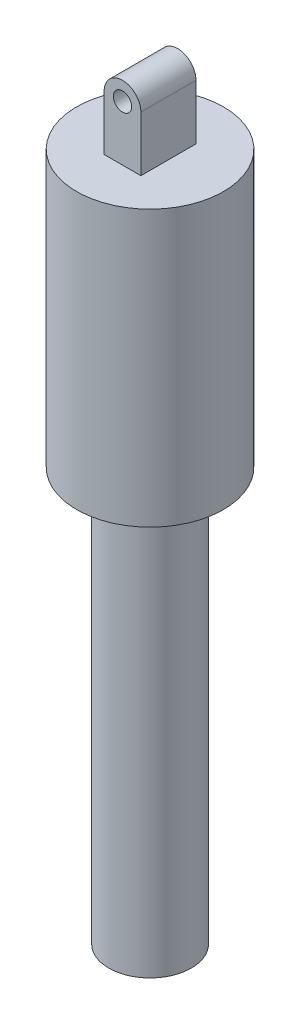
ISO-10303-21;
HEADER;
FILE_DESCRIPTION(('STEP AP214'),'2;1');
FILE_NAME('part.step','',(''),(''),'','','');
FILE_SCHEMA(('AUTOMOTIVE_DESIGN { 1 0 10303 214 1 1 1 1 }'));
ENDSEC;
DATA;
#1=APPLICATION_CONTEXT('core data for automotive mechanical design processes');
#2=APPLICATION_PROTOCOL_DEFINITION('international standard','automotive_design',2000,#1);
#3=PRODUCT_CONTEXT('',#1,'mechanical');
#4=PRODUCT('Part','Part','',(#3));
#5=PRODUCT_RELATED_PRODUCT_CATEGORY('part','',(#4));
#6=PRODUCT_DEFINITION_FORMATION('','',#4);
#7=PRODUCT_DEFINITION_CONTEXT('part definition',#1,'design');
#8=PRODUCT_DEFINITION('design','',#6,#7);
#9=PRODUCT_DEFINITION_SHAPE('','',#8);
#10=(LENGTH_UNIT() NAMED_UNIT(*) SI_UNIT(.MILLI.,.METRE.));
#11=(NAMED_UNIT(*) PLANE_ANGLE_UNIT() SI_UNIT($,.RADIAN.));
#12=(NAMED_UNIT(*) SI_UNIT($,.STERADIAN.) SOLID_ANGLE_UNIT());
#13=UNCERTAINTY_MEASURE_WITH_UNIT(LENGTH_MEASURE(1.E-05),#10,'distance_accuracy_value','');
#14=(GEOMETRIC_REPRESENTATION_CONTEXT(3) GLOBAL_UNCERTAINTY_ASSIGNED_CONTEXT((#13)) GLOBAL_UNIT_ASSIGNED_CONTEXT((#10,
#11,#12)) REPRESENTATION_CONTEXT('',''));
#15=CARTESIAN_POINT('',(0.,0.,0.));
#16=DIRECTION('',(0.,0.,1.));
#17=DIRECTION('',(1.,0.,0.));
#18=AXIS2_PLACEMENT_3D('',#15,#16,#17);
#19=CARTESIAN_POINT('',(0.,150.,0.));
#20=DIRECTION('',(0.,1.,0.));
#21=DIRECTION('',(0.,0.,1.));
#22=AXIS2_PLACEMENT_3D('',#19,#20,#21);
#23=PLANE('',#22);
#24=CARTESIAN_POINT('',(0.,150.,0.));
#25=DIRECTION('',(0.,-1.,0.));
#26=DIRECTION('',(0.,0.,-1.));
#27=AXIS2_PLACEMENT_3D('',#24,#25,#26);
#28=CIRCLE('',#27,40.);
#29=CARTESIAN_POINT('',(0.,150.,-40.));
#30=VERTEX_POINT('',#29);
#31=EDGE_CURVE('E113',#30,#30,#28,.T.);
#32=ORIENTED_EDGE('',*,*,#31,.F.);
#33=EDGE_LOOP('',(#32));
#34=FACE_BOUND('',#33,.T.);
#35=DIRECTION('',(1.,0.,0.));
#36=VECTOR('',#35,1.);
#37=CARTESIAN_POINT('',(10.,150.,-15.));
#38=LINE('',#37,#36);
#39=CARTESIAN_POINT('',(-10.,150.,-15.));
#40=VERTEX_POINT('',#39);
#41=CARTESIAN_POINT('',(10.,150.,-15.));
#42=VERTEX_POINT('',#41);
#43=EDGE_CURVE('E48',#40,#42,#38,.T.);
#44=ORIENTED_EDGE('',*,*,#43,.T.);
#45=DIRECTION('',(0.,0.,-1.));
#46=VECTOR('',#45,1.);
#47=CARTESIAN_POINT('',(10.,150.,15.));
#48=LINE('',#47,#46);
#49=CARTESIAN_POINT('',(10.,150.,15.));
#50=VERTEX_POINT('',#49);
#51=EDGE_CURVE('E94',#50,#42,#48,.T.);
#52=ORIENTED_EDGE('',*,*,#51,.F.);
#53=DIRECTION('',(1.,0.,0.));
#54=VECTOR('',#53,1.);
#55=CARTESIAN_POINT('',(10.,150.,15.));
#56=LINE('',#55,#54);
#57=CARTESIAN_POINT('',(-10.,150.,15.));
#58=VERTEX_POINT('',#57);
#59=EDGE_CURVE('E88',#58,#50,#56,.T.);
#60=ORIENTED_EDGE('',*,*,#59,.F.);
#61=DIRECTION('',(0.,0.,-1.));
#62=VECTOR('',#61,1.);
#63=CARTESIAN_POINT('',(-10.,150.,15.));
#64=LINE('',#63,#62);
#65=EDGE_CURVE('E99',#58,#40,#64,.T.);
#66=ORIENTED_EDGE('',*,*,#65,.T.);
#67=EDGE_LOOP('',(#44,#52,#60,#66));
#68=FACE_BOUND('',#67,.T.);
#69=ADVANCED_FACE('F33',(#34,#68),#23,.T.);
#70=CARTESIAN_POINT('',(9.,0.,0.));
#71=DIRECTION('',(0.,-1.,0.));
#72=DIRECTION('',(0.,0.,-1.));
#73=AXIS2_PLACEMENT_3D('',#70,#71,#72);
#74=PLANE('',#73);
#75=CARTESIAN_POINT('',(0.,0.,0.));
#76=DIRECTION('',(0.,-1.,0.));
#77=DIRECTION('',(0.,0.,-1.));
#78=AXIS2_PLACEMENT_3D('',#75,#76,#77);
#79=CIRCLE('',#78,9.);
#80=CARTESIAN_POINT('',(0.,0.,-9.));
#81=VERTEX_POINT('',#80);
#82=EDGE_CURVE('E11',#81,#81,#79,.T.);
#83=ORIENTED_EDGE('',*,*,#82,.T.);
#84=EDGE_LOOP('',(#83));
#85=FACE_BOUND('',#84,.T.);
#86=ADVANCED_FACE('F35',(#85),#74,.T.);
#87=CARTESIAN_POINT('',(0.,0.,0.));
#88=DIRECTION('',(0.,-1.,0.));
#89=DIRECTION('',(0.,0.,-1.));
#90=AXIS2_PLACEMENT_3D('',#87,#88,#89);
#91=CYLINDRICAL_SURFACE('',#90,9.);
#92=CARTESIAN_POINT('',(0.,-225.,0.));
#93=DIRECTION('',(0.,-1.,0.));
#94=DIRECTION('',(0.,0.,-1.));
#95=AXIS2_PLACEMENT_3D('',#92,#93,#94);
#96=CIRCLE('',#95,9.);
#97=CARTESIAN_POINT('',(0.,-225.,-9.));
#98=VERTEX_POINT('',#97);
#99=EDGE_CURVE('E41',#98,#98,#96,.T.);
#100=ORIENTED_EDGE('',*,*,#99,.T.);
#101=EDGE_LOOP('',(#100));
#102=FACE_BOUND('',#101,.T.);
#103=ORIENTED_EDGE('',*,*,#82,.F.);
#104=EDGE_LOOP('',(#103));
#105=FACE_BOUND('',#104,.T.);
#106=ADVANCED_FACE('F127',(#102,#105),#91,.F.);
#107=CARTESIAN_POINT('',(22.5,-225.,0.));
#108=DIRECTION('',(0.,-1.,0.));
#109=DIRECTION('',(0.,0.,-1.));
#110=AXIS2_PLACEMENT_3D('',#107,#108,#109);
#111=PLANE('',#110);
#112=CARTESIAN_POINT('',(0.,-225.,0.));
#113=DIRECTION('',(0.,-1.,0.));
#114=DIRECTION('',(0.,0.,-1.));
#115=AXIS2_PLACEMENT_3D('',#112,#113,#114);
#116=CIRCLE('',#115,22.5);
#117=CARTESIAN_POINT('',(0.,-225.,-22.5));
#118=VERTEX_POINT('',#117);
#119=EDGE_CURVE('E122',#118,#118,#116,.T.);
#120=ORIENTED_EDGE('',*,*,#119,.T.);
#121=EDGE_LOOP('',(#120));
#122=FACE_BOUND('',#121,.T.);
#123=ORIENTED_EDGE('',*,*,#99,.F.);
#124=EDGE_LOOP('',(#123));
#125=FACE_BOUND('',#124,.T.);
#126=ADVANCED_FACE('F130',(#122,#125),#111,.T.);
#127=CARTESIAN_POINT('',(0.,0.,0.));
#128=DIRECTION('',(0.,-1.,0.));
#129=DIRECTION('',(0.,0.,-1.));
#130=AXIS2_PLACEMENT_3D('',#127,#128,#129);
#131=CYLINDRICAL_SURFACE('',#130,22.5);
#132=CARTESIAN_POINT('',(0.,0.,0.));
#133=DIRECTION('',(0.,-1.,0.));
#134=DIRECTION('',(0.,0.,-1.));
#135=AXIS2_PLACEMENT_3D('',#132,#133,#134);
#136=CIRCLE('',#135,22.5);
#137=CARTESIAN_POINT('',(0.,0.,-22.5));
#138=VERTEX_POINT('',#137);
#139=EDGE_CURVE('E119',#138,#138,#136,.T.);
#140=ORIENTED_EDGE('',*,*,#139,.T.);
#141=EDGE_LOOP('',(#140));
#142=FACE_BOUND('',#141,.T.);
#143=ORIENTED_EDGE('',*,*,#119,.F.);
#144=EDGE_LOOP('',(#143));
#145=FACE_BOUND('',#144,.T.);
#146=ADVANCED_FACE('F132',(#142,#145),#131,.T.);
#147=CARTESIAN_POINT('',(22.5,0.,0.));
#148=DIRECTION('',(0.,-1.,0.));
#149=DIRECTION('',(0.,0.,-1.));
#150=AXIS2_PLACEMENT_3D('',#147,#148,#149);
#151=PLANE('',#150);
#152=CARTESIAN_POINT('',(0.,0.,0.));
#153=DIRECTION('',(0.,-1.,0.));
#154=DIRECTION('',(0.,0.,-1.));
#155=AXIS2_PLACEMENT_3D('',#152,#153,#154);
#156=CIRCLE('',#155,40.);
#157=CARTESIAN_POINT('',(0.,0.,-40.));
#158=VERTEX_POINT('',#157);
#159=EDGE_CURVE('E116',#158,#158,#156,.T.);
#160=ORIENTED_EDGE('',*,*,#159,.T.);
#161=EDGE_LOOP('',(#160));
#162=FACE_BOUND('',#161,.T.);
#163=ORIENTED_EDGE('',*,*,#139,.F.);
#164=EDGE_LOOP('',(#163));
#165=FACE_BOUND('',#164,.T.);
#166=ADVANCED_FACE('F139',(#162,#165),#151,.T.);
#167=CARTESIAN_POINT('',(0.,0.,0.));
#168=DIRECTION('',(0.,-1.,0.));
#169=DIRECTION('',(0.,0.,-1.));
#170=AXIS2_PLACEMENT_3D('',#167,#168,#169);
#171=CYLINDRICAL_SURFACE('',#170,40.);
#172=ORIENTED_EDGE('',*,*,#31,.T.);
#173=EDGE_LOOP('',(#172));
#174=FACE_BOUND('',#173,.T.);
#175=ORIENTED_EDGE('',*,*,#159,.F.);
#176=EDGE_LOOP('',(#175));
#177=FACE_BOUND('',#176,.T.);
#178=ADVANCED_FACE('F154',(#174,#177),#171,.T.);
#179=CARTESIAN_POINT('',(0.,180.,15.));
#180=DIRECTION('',(0.,0.,1.));
#181=DIRECTION('',(1.,0.,0.));
#182=AXIS2_PLACEMENT_3D('',#179,#180,#181);
#183=PLANE('',#182);
#184=ORIENTED_EDGE('',*,*,#59,.T.);
#185=DIRECTION('',(0.,1.,0.));
#186=VECTOR('',#185,1.);
#187=CARTESIAN_POINT('',(10.,150.,15.));
#188=LINE('',#187,#186);
#189=CARTESIAN_POINT('',(10.,180.,15.));
#190=VERTEX_POINT('',#189);
#191=EDGE_CURVE('E82',#50,#190,#188,.T.);
#192=ORIENTED_EDGE('',*,*,#191,.T.);
#193=CARTESIAN_POINT('',(0.,180.,15.));
#194=DIRECTION('',(0.,0.,1.));
#195=DIRECTION('',(1.,0.,0.));
#196=AXIS2_PLACEMENT_3D('',#193,#194,#195);
#197=CIRCLE('',#196,10.);
#198=CARTESIAN_POINT('',(-10.,180.,15.));
#199=VERTEX_POINT('',#198);
#200=EDGE_CURVE('E86',#190,#199,#197,.T.);
#201=ORIENTED_EDGE('',*,*,#200,.T.);
#202=DIRECTION('',(0.,-1.,0.));
#203=VECTOR('',#202,1.);
#204=CARTESIAN_POINT('',(-10.,150.,15.));
#205=LINE('',#204,#203);
#206=EDGE_CURVE('E57',#199,#58,#205,.T.);
#207=ORIENTED_EDGE('',*,*,#206,.T.);
#208=EDGE_LOOP('',(#184,#192,#201,#207));
#209=FACE_BOUND('',#208,.T.);
#210=CARTESIAN_POINT('',(0.,180.,15.));
#211=DIRECTION('',(0.,0.,1.));
#212=DIRECTION('',(1.,0.,0.));
#213=AXIS2_PLACEMENT_3D('',#210,#211,#212);
#214=CIRCLE('',#213,5.);
#215=CARTESIAN_POINT('',(5.,180.,15.));
#216=VERTEX_POINT('',#215);
#217=EDGE_CURVE('E104',#216,#216,#214,.T.);
#218=ORIENTED_EDGE('',*,*,#217,.F.);
#219=EDGE_LOOP('',(#218));
#220=FACE_BOUND('',#219,.T.);
#221=ADVANCED_FACE('F83',(#209,#220),#183,.T.);
#222=CARTESIAN_POINT('',(0.,180.,-15.));
#223=DIRECTION('',(0.,0.,1.));
#224=DIRECTION('',(1.,0.,0.));
#225=AXIS2_PLACEMENT_3D('',#222,#223,#224);
#226=PLANE('',#225);
#227=ORIENTED_EDGE('',*,*,#43,.F.);
#228=DIRECTION('',(0.,-1.,0.));
#229=VECTOR('',#228,1.);
#230=CARTESIAN_POINT('',(-10.,150.,-15.));
#231=LINE('',#230,#229);
#232=CARTESIAN_POINT('',(-10.,180.,-15.));
#233=VERTEX_POINT('',#232);
#234=EDGE_CURVE('E107',#233,#40,#231,.T.);
#235=ORIENTED_EDGE('',*,*,#234,.F.);
#236=CARTESIAN_POINT('',(0.,180.,-15.));
#237=DIRECTION('',(0.,0.,1.));
#238=DIRECTION('',(1.,0.,0.));
#239=AXIS2_PLACEMENT_3D('',#236,#237,#238);
#240=CIRCLE('',#239,10.);
#241=CARTESIAN_POINT('',(10.,180.,-15.));
#242=VERTEX_POINT('',#241);
#243=EDGE_CURVE('E74',#242,#233,#240,.T.);
#244=ORIENTED_EDGE('',*,*,#243,.F.);
#245=DIRECTION('',(0.,1.,0.));
#246=VECTOR('',#245,1.);
#247=CARTESIAN_POINT('',(10.,150.,-15.));
#248=LINE('',#247,#246);
#249=EDGE_CURVE('E93',#42,#242,#248,.T.);
#250=ORIENTED_EDGE('',*,*,#249,.F.);
#251=EDGE_LOOP('',(#227,#235,#244,#250));
#252=FACE_BOUND('',#251,.T.);
#253=CARTESIAN_POINT('',(0.,180.,-15.));
#254=DIRECTION('',(0.,0.,1.));
#255=DIRECTION('',(1.,0.,0.));
#256=AXIS2_PLACEMENT_3D('',#253,#254,#255);
#257=CIRCLE('',#256,5.);
#258=CARTESIAN_POINT('',(5.,180.,-15.));
#259=VERTEX_POINT('',#258);
#260=EDGE_CURVE('E260',#259,#259,#257,.T.);
#261=ORIENTED_EDGE('',*,*,#260,.T.);
#262=EDGE_LOOP('',(#261));
#263=FACE_BOUND('',#262,.T.);
#264=ADVANCED_FACE('F180',(#252,#263),#226,.F.);
#265=CARTESIAN_POINT('',(10.,150.,15.));
#266=DIRECTION('',(-1.,0.,0.));
#267=DIRECTION('',(0.,0.,1.));
#268=AXIS2_PLACEMENT_3D('',#265,#266,#267);
#269=PLANE('',#268);
#270=ORIENTED_EDGE('',*,*,#249,.T.);
#271=DIRECTION('',(0.,0.,-1.));
#272=VECTOR('',#271,1.);
#273=CARTESIAN_POINT('',(10.,180.,15.));
#274=LINE('',#273,#272);
#275=EDGE_CURVE('E91',#190,#242,#274,.T.);
#276=ORIENTED_EDGE('',*,*,#275,.F.);
#277=ORIENTED_EDGE('',*,*,#191,.F.);
#278=ORIENTED_EDGE('',*,*,#51,.T.);
#279=EDGE_LOOP('',(#270,#276,#277,#278));
#280=FACE_BOUND('',#279,.T.);
#281=ADVANCED_FACE('F92',(#280),#269,.F.);
#282=CARTESIAN_POINT('',(0.,180.,15.));
#283=DIRECTION('',(0.,0.,-1.));
#284=DIRECTION('',(-1.,0.,0.));
#285=AXIS2_PLACEMENT_3D('',#282,#283,#284);
#286=CYLINDRICAL_SURFACE('',#285,10.);
#287=ORIENTED_EDGE('',*,*,#243,.T.);
#288=DIRECTION('',(0.,0.,-1.));
#289=VECTOR('',#288,1.);
#290=CARTESIAN_POINT('',(-10.,180.,15.));
#291=LINE('',#290,#289);
#292=EDGE_CURVE('E95',#199,#233,#291,.T.);
#293=ORIENTED_EDGE('',*,*,#292,.F.);
#294=ORIENTED_EDGE('',*,*,#200,.F.);
#295=ORIENTED_EDGE('',*,*,#275,.T.);
#296=EDGE_LOOP('',(#287,#293,#294,#295));
#297=FACE_BOUND('',#296,.T.);
#298=ADVANCED_FACE('F97',(#297),#286,.T.);
#299=CARTESIAN_POINT('',(-10.,150.,15.));
#300=DIRECTION('',(1.,0.,0.));
#301=DIRECTION('',(0.,0.,-1.));
#302=AXIS2_PLACEMENT_3D('',#299,#300,#301);
#303=PLANE('',#302);
#304=ORIENTED_EDGE('',*,*,#234,.T.);
#305=ORIENTED_EDGE('',*,*,#65,.F.);
#306=ORIENTED_EDGE('',*,*,#206,.F.);
#307=ORIENTED_EDGE('',*,*,#292,.T.);
#308=EDGE_LOOP('',(#304,#305,#306,#307));
#309=FACE_BOUND('',#308,.T.);
#310=ADVANCED_FACE('F198',(#309),#303,.F.);
#311=CARTESIAN_POINT('',(0.,180.,15.));
#312=DIRECTION('',(0.,0.,-1.));
#313=DIRECTION('',(-1.,0.,0.));
#314=AXIS2_PLACEMENT_3D('',#311,#312,#313);
#315=CYLINDRICAL_SURFACE('',#314,5.);
#316=ORIENTED_EDGE('',*,*,#217,.T.);
#317=EDGE_LOOP('',(#316));
#318=FACE_BOUND('',#317,.T.);
#319=ORIENTED_EDGE('',*,*,#260,.F.);
#320=EDGE_LOOP('',(#319));
#321=FACE_BOUND('',#320,.T.);
#322=ADVANCED_FACE('F204',(#318,#321),#315,.F.);
#323=CLOSED_SHELL('',(#69,#86,#106,#126,#146,#166,#178,#221,#264,#281,#298,#310,#322));
#324=MANIFOLD_SOLID_BREP('B2',#323);
#325=ADVANCED_BREP_SHAPE_REPRESENTATION('',(#18,#324),#14);
#326=SHAPE_DEFINITION_REPRESENTATION(#9,#325);
ENDSEC;
END-ISO-10303-21;
